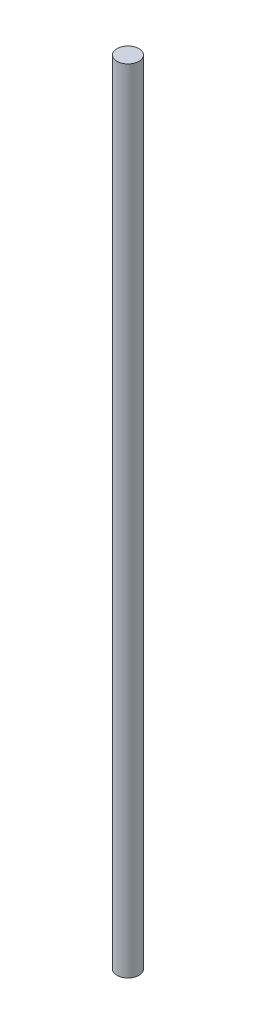
ISO-10303-21;
HEADER;
FILE_DESCRIPTION(('STEP AP214'),'2;1');
FILE_NAME('part.step','',(''),(''),'','','');
FILE_SCHEMA(('AUTOMOTIVE_DESIGN { 1 0 10303 214 1 1 1 1 }'));
ENDSEC;
DATA;
#1=APPLICATION_CONTEXT('core data for automotive mechanical design processes');
#2=APPLICATION_PROTOCOL_DEFINITION('international standard','automotive_design',2000,#1);
#3=PRODUCT_CONTEXT('',#1,'mechanical');
#4=PRODUCT('Part','Part','',(#3));
#5=PRODUCT_RELATED_PRODUCT_CATEGORY('part','',(#4));
#6=PRODUCT_DEFINITION_FORMATION('','',#4);
#7=PRODUCT_DEFINITION_CONTEXT('part definition',#1,'design');
#8=PRODUCT_DEFINITION('design','',#6,#7);
#9=PRODUCT_DEFINITION_SHAPE('','',#8);
#10=(LENGTH_UNIT() NAMED_UNIT(*) SI_UNIT(.MILLI.,.METRE.));
#11=(NAMED_UNIT(*) PLANE_ANGLE_UNIT() SI_UNIT($,.RADIAN.));
#12=(NAMED_UNIT(*) SI_UNIT($,.STERADIAN.) SOLID_ANGLE_UNIT());
#13=UNCERTAINTY_MEASURE_WITH_UNIT(LENGTH_MEASURE(1.E-05),#10,'distance_accuracy_value','');
#14=(GEOMETRIC_REPRESENTATION_CONTEXT(3) GLOBAL_UNCERTAINTY_ASSIGNED_CONTEXT((#13)) GLOBAL_UNIT_ASSIGNED_CONTEXT((#10,
#11,#12)) REPRESENTATION_CONTEXT('',''));
#15=CARTESIAN_POINT('',(0.,0.,0.));
#16=DIRECTION('',(0.,0.,1.));
#17=DIRECTION('',(1.,0.,0.));
#18=AXIS2_PLACEMENT_3D('',#15,#16,#17);
#19=CARTESIAN_POINT('',(0.,228.6,0.));
#20=DIRECTION('',(0.,-1.,0.));
#21=DIRECTION('',(0.,0.,-1.));
#22=AXIS2_PLACEMENT_3D('',#19,#20,#21);
#23=CYLINDRICAL_SURFACE('',#22,3.175);
#24=CARTESIAN_POINT('',(0.,228.6,0.));
#25=DIRECTION('',(0.,1.,0.));
#26=DIRECTION('',(0.,0.,1.));
#27=AXIS2_PLACEMENT_3D('',#24,#25,#26);
#28=CIRCLE('',#27,3.175);
#29=CARTESIAN_POINT('',(0.,228.6,3.175));
#30=VERTEX_POINT('',#29);
#31=EDGE_CURVE('E10',#30,#30,#28,.T.);
#32=ORIENTED_EDGE('',*,*,#31,.F.);
#33=EDGE_LOOP('',(#32));
#34=FACE_BOUND('',#33,.T.);
#35=CARTESIAN_POINT('',(0.,0.,0.));
#36=DIRECTION('',(0.,1.,0.));
#37=DIRECTION('',(0.,0.,1.));
#38=AXIS2_PLACEMENT_3D('',#35,#36,#37);
#39=CIRCLE('',#38,3.175);
#40=CARTESIAN_POINT('',(0.,0.,3.175));
#41=VERTEX_POINT('',#40);
#42=EDGE_CURVE('E46',#41,#41,#39,.T.);
#43=ORIENTED_EDGE('',*,*,#42,.T.);
#44=EDGE_LOOP('',(#43));
#45=FACE_BOUND('',#44,.T.);
#46=ADVANCED_FACE('F43',(#34,#45),#23,.T.);
#47=CARTESIAN_POINT('',(0.,228.6,0.));
#48=DIRECTION('',(0.,1.,0.));
#49=DIRECTION('',(0.,0.,1.));
#50=AXIS2_PLACEMENT_3D('',#47,#48,#49);
#51=PLANE('',#50);
#52=ORIENTED_EDGE('',*,*,#31,.T.);
#53=EDGE_LOOP('',(#52));
#54=FACE_BOUND('',#53,.T.);
#55=ADVANCED_FACE('F58',(#54),#51,.T.);
#56=CARTESIAN_POINT('',(0.,0.,0.));
#57=DIRECTION('',(0.,1.,0.));
#58=DIRECTION('',(0.,0.,1.));
#59=AXIS2_PLACEMENT_3D('',#56,#57,#58);
#60=PLANE('',#59);
#61=ORIENTED_EDGE('',*,*,#42,.F.);
#62=EDGE_LOOP('',(#61));
#63=FACE_BOUND('',#62,.T.);
#64=ADVANCED_FACE('F56',(#63),#60,.F.);
#65=CLOSED_SHELL('',(#46,#55,#64));
#66=MANIFOLD_SOLID_BREP('B2',#65);
#67=ADVANCED_BREP_SHAPE_REPRESENTATION('',(#18,#66),#14);
#68=SHAPE_DEFINITION_REPRESENTATION(#9,#67);
ENDSEC;
END-ISO-10303-21;
